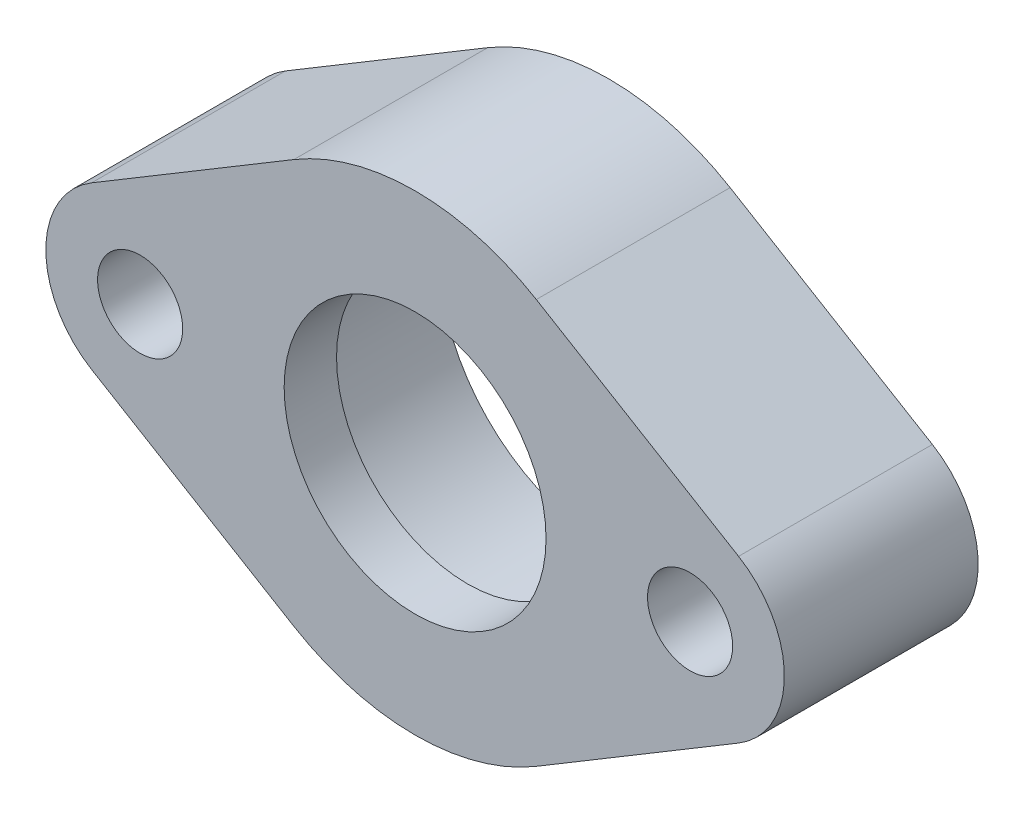
ISO-10303-21;
HEADER;
FILE_DESCRIPTION(('STEP AP214'),'2;1');
FILE_NAME('part.step','',(''),(''),'','','');
FILE_SCHEMA(('AUTOMOTIVE_DESIGN { 1 0 10303 214 1 1 1 1 }'));
ENDSEC;
DATA;
#1=APPLICATION_CONTEXT('core data for automotive mechanical design processes');
#2=APPLICATION_PROTOCOL_DEFINITION('international standard','automotive_design',2000,#1);
#3=PRODUCT_CONTEXT('',#1,'mechanical');
#4=PRODUCT('Part','Part','',(#3));
#5=PRODUCT_RELATED_PRODUCT_CATEGORY('part','',(#4));
#6=PRODUCT_DEFINITION_FORMATION('','',#4);
#7=PRODUCT_DEFINITION_CONTEXT('part definition',#1,'design');
#8=PRODUCT_DEFINITION('design','',#6,#7);
#9=PRODUCT_DEFINITION_SHAPE('','',#8);
#10=(LENGTH_UNIT() NAMED_UNIT(*) SI_UNIT(.MILLI.,.METRE.));
#11=(NAMED_UNIT(*) PLANE_ANGLE_UNIT() SI_UNIT($,.RADIAN.));
#12=(NAMED_UNIT(*) SI_UNIT($,.STERADIAN.) SOLID_ANGLE_UNIT());
#13=UNCERTAINTY_MEASURE_WITH_UNIT(LENGTH_MEASURE(1.E-05),#10,'distance_accuracy_value','');
#14=(GEOMETRIC_REPRESENTATION_CONTEXT(3) GLOBAL_UNCERTAINTY_ASSIGNED_CONTEXT((#13)) GLOBAL_UNIT_ASSIGNED_CONTEXT((#10,
#11,#12)) REPRESENTATION_CONTEXT('',''));
#15=CARTESIAN_POINT('',(0.,0.,0.));
#16=DIRECTION('',(0.,0.,1.));
#17=DIRECTION('',(1.,0.,0.));
#18=AXIS2_PLACEMENT_3D('',#15,#16,#17);
#19=CARTESIAN_POINT('',(-33.3375,0.,0.));
#20=DIRECTION('',(0.,0.,1.));
#21=DIRECTION('',(1.,0.,0.));
#22=AXIS2_PLACEMENT_3D('',#19,#20,#21);
#23=PLANE('',#22);
#24=CARTESIAN_POINT('',(33.3375,0.,0.));
#25=DIRECTION('',(0.,0.,1.));
#26=DIRECTION('',(1.,0.,0.));
#27=AXIS2_PLACEMENT_3D('',#24,#25,#26);
#28=CIRCLE('',#27,5.1562);
#29=CARTESIAN_POINT('',(38.4937,0.,0.));
#30=VERTEX_POINT('',#29);
#31=EDGE_CURVE('E239',#30,#30,#28,.T.);
#32=ORIENTED_EDGE('',*,*,#31,.T.);
#33=EDGE_LOOP('',(#32));
#34=FACE_BOUND('',#33,.T.);
#35=CARTESIAN_POINT('',(-33.3375,0.,0.));
#36=DIRECTION('',(0.,0.,1.));
#37=DIRECTION('',(1.,0.,0.));
#38=AXIS2_PLACEMENT_3D('',#35,#36,#37);
#39=CIRCLE('',#38,11.43);
#40=CARTESIAN_POINT('',(-39.2157857142857,9.8025842032203,0.));
#41=VERTEX_POINT('',#40);
#42=CARTESIAN_POINT('',(-39.2157857142857,-9.80258420322032,0.));
#43=VERTEX_POINT('',#42);
#44=EDGE_CURVE('E133',#41,#43,#39,.T.);
#45=ORIENTED_EDGE('',*,*,#44,.F.);
#46=DIRECTION('',(-0.857618915417351,-0.514285714285714,0.));
#47=VECTOR('',#46,1.);
#48=CARTESIAN_POINT('',(-39.2157857142857,9.8025842032203,0.));
#49=LINE('',#48,#47);
#50=CARTESIAN_POINT('',(-14.6957142857143,24.5064605080508,0.));
#51=VERTEX_POINT('',#50);
#52=EDGE_CURVE('E86',#51,#41,#49,.T.);
#53=ORIENTED_EDGE('',*,*,#52,.F.);
#54=CARTESIAN_POINT('',(0.,0.,0.));
#55=DIRECTION('',(0.,0.,1.));
#56=DIRECTION('',(1.,0.,0.));
#57=AXIS2_PLACEMENT_3D('',#54,#55,#56);
#58=CIRCLE('',#57,28.575);
#59=CARTESIAN_POINT('',(14.6957142857143,24.5064605080508,0.));
#60=VERTEX_POINT('',#59);
#61=EDGE_CURVE('E80',#60,#51,#58,.T.);
#62=ORIENTED_EDGE('',*,*,#61,.F.);
#63=DIRECTION('',(-0.857618915417351,0.514285714285714,0.));
#64=VECTOR('',#63,1.);
#65=CARTESIAN_POINT('',(14.6957142857143,24.5064605080508,0.));
#66=LINE('',#65,#64);
#67=CARTESIAN_POINT('',(39.2157857142857,9.80258420322031,0.));
#68=VERTEX_POINT('',#67);
#69=EDGE_CURVE('E123',#68,#60,#66,.T.);
#70=ORIENTED_EDGE('',*,*,#69,.F.);
#71=CARTESIAN_POINT('',(33.3375,0.,0.));
#72=DIRECTION('',(0.,0.,1.));
#73=DIRECTION('',(1.,0.,0.));
#74=AXIS2_PLACEMENT_3D('',#71,#72,#73);
#75=CIRCLE('',#74,11.43);
#76=CARTESIAN_POINT('',(39.2157857142857,-9.8025842032203,0.));
#77=VERTEX_POINT('',#76);
#78=EDGE_CURVE('E143',#77,#68,#75,.T.);
#79=ORIENTED_EDGE('',*,*,#78,.F.);
#80=DIRECTION('',(0.857618915417351,0.514285714285714,0.));
#81=VECTOR('',#80,1.);
#82=CARTESIAN_POINT('',(39.2157857142857,-9.80258420322031,0.));
#83=LINE('',#82,#81);
#84=CARTESIAN_POINT('',(14.6957142857143,-24.5064605080508,0.));
#85=VERTEX_POINT('',#84);
#86=EDGE_CURVE('E141',#85,#77,#83,.T.);
#87=ORIENTED_EDGE('',*,*,#86,.F.);
#88=CARTESIAN_POINT('',(0.,0.,0.));
#89=DIRECTION('',(0.,0.,1.));
#90=DIRECTION('',(1.,0.,0.));
#91=AXIS2_PLACEMENT_3D('',#88,#89,#90);
#92=CIRCLE('',#91,28.575);
#93=CARTESIAN_POINT('',(-14.6957142857143,-24.5064605080508,0.));
#94=VERTEX_POINT('',#93);
#95=EDGE_CURVE('E139',#94,#85,#92,.T.);
#96=ORIENTED_EDGE('',*,*,#95,.F.);
#97=DIRECTION('',(0.857618915417351,-0.514285714285714,0.));
#98=VECTOR('',#97,1.);
#99=CARTESIAN_POINT('',(-14.6957142857143,-24.5064605080508,0.));
#100=LINE('',#99,#98);
#101=EDGE_CURVE('E136',#43,#94,#100,.T.);
#102=ORIENTED_EDGE('',*,*,#101,.F.);
#103=EDGE_LOOP('',(#45,#53,#62,#70,#79,#87,#96,#102));
#104=FACE_BOUND('',#103,.T.);
#105=CARTESIAN_POINT('',(-33.3375,0.,0.));
#106=DIRECTION('',(0.,0.,1.));
#107=DIRECTION('',(1.,0.,0.));
#108=AXIS2_PLACEMENT_3D('',#105,#106,#107);
#109=CIRCLE('',#108,5.1562);
#110=CARTESIAN_POINT('',(-28.1813,0.,0.));
#111=VERTEX_POINT('',#110);
#112=EDGE_CURVE('E233',#111,#111,#109,.T.);
#113=ORIENTED_EDGE('',*,*,#112,.T.);
#114=EDGE_LOOP('',(#113));
#115=FACE_BOUND('',#114,.T.);
#116=CARTESIAN_POINT('',(0.,0.,0.));
#117=DIRECTION('',(0.,0.,1.));
#118=DIRECTION('',(1.,0.,0.));
#119=AXIS2_PLACEMENT_3D('',#116,#117,#118);
#120=CIRCLE('',#119,20.64385);
#121=CARTESIAN_POINT('',(20.64385,0.,0.));
#122=VERTEX_POINT('',#121);
#123=EDGE_CURVE('E241',#122,#122,#120,.T.);
#124=ORIENTED_EDGE('',*,*,#123,.T.);
#125=EDGE_LOOP('',(#124));
#126=FACE_BOUND('',#125,.T.);
#127=ADVANCED_FACE('F34',(#34,#104,#115,#126),#23,.F.);
#128=CARTESIAN_POINT('',(-33.3375,0.,23.495));
#129=DIRECTION('',(0.,0.,1.));
#130=DIRECTION('',(1.,0.,0.));
#131=AXIS2_PLACEMENT_3D('',#128,#129,#130);
#132=PLANE('',#131);
#133=CARTESIAN_POINT('',(0.,0.,23.495));
#134=DIRECTION('',(0.,0.,-1.));
#135=DIRECTION('',(-1.,0.,0.));
#136=AXIS2_PLACEMENT_3D('',#133,#134,#135);
#137=CIRCLE('',#136,15.875);
#138=CARTESIAN_POINT('',(-15.875,0.,23.495));
#139=VERTEX_POINT('',#138);
#140=EDGE_CURVE('E246',#139,#139,#137,.T.);
#141=ORIENTED_EDGE('',*,*,#140,.T.);
#142=EDGE_LOOP('',(#141));
#143=FACE_BOUND('',#142,.T.);
#144=CARTESIAN_POINT('',(-33.3375,0.,23.495));
#145=DIRECTION('',(0.,0.,1.));
#146=DIRECTION('',(1.,0.,0.));
#147=AXIS2_PLACEMENT_3D('',#144,#145,#146);
#148=CIRCLE('',#147,5.1562);
#149=CARTESIAN_POINT('',(-28.1813,0.,23.495));
#150=VERTEX_POINT('',#149);
#151=EDGE_CURVE('E137',#150,#150,#148,.T.);
#152=ORIENTED_EDGE('',*,*,#151,.F.);
#153=EDGE_LOOP('',(#152));
#154=FACE_BOUND('',#153,.T.);
#155=CARTESIAN_POINT('',(-33.3375,0.,23.495));
#156=DIRECTION('',(0.,0.,1.));
#157=DIRECTION('',(1.,0.,0.));
#158=AXIS2_PLACEMENT_3D('',#155,#156,#157);
#159=CIRCLE('',#158,11.43);
#160=CARTESIAN_POINT('',(-39.2157857142857,9.8025842032203,23.495));
#161=VERTEX_POINT('',#160);
#162=CARTESIAN_POINT('',(-39.2157857142857,-9.80258420322032,23.495));
#163=VERTEX_POINT('',#162);
#164=EDGE_CURVE('E148',#161,#163,#159,.T.);
#165=ORIENTED_EDGE('',*,*,#164,.T.);
#166=DIRECTION('',(0.857618915417351,-0.514285714285714,0.));
#167=VECTOR('',#166,1.);
#168=CARTESIAN_POINT('',(-14.6957142857143,-24.5064605080508,23.495));
#169=LINE('',#168,#167);
#170=CARTESIAN_POINT('',(-14.6957142857143,-24.5064605080508,23.495));
#171=VERTEX_POINT('',#170);
#172=EDGE_CURVE('E95',#163,#171,#169,.T.);
#173=ORIENTED_EDGE('',*,*,#172,.T.);
#174=CARTESIAN_POINT('',(0.,0.,23.495));
#175=DIRECTION('',(0.,0.,1.));
#176=DIRECTION('',(1.,0.,0.));
#177=AXIS2_PLACEMENT_3D('',#174,#175,#176);
#178=CIRCLE('',#177,28.575);
#179=CARTESIAN_POINT('',(14.6957142857143,-24.5064605080508,23.495));
#180=VERTEX_POINT('',#179);
#181=EDGE_CURVE('E225',#171,#180,#178,.T.);
#182=ORIENTED_EDGE('',*,*,#181,.T.);
#183=DIRECTION('',(0.857618915417351,0.514285714285714,0.));
#184=VECTOR('',#183,1.);
#185=CARTESIAN_POINT('',(39.2157857142857,-9.80258420322031,23.495));
#186=LINE('',#185,#184);
#187=CARTESIAN_POINT('',(39.2157857142857,-9.8025842032203,23.495));
#188=VERTEX_POINT('',#187);
#189=EDGE_CURVE('E227',#180,#188,#186,.T.);
#190=ORIENTED_EDGE('',*,*,#189,.T.);
#191=CARTESIAN_POINT('',(33.3375,0.,23.495));
#192=DIRECTION('',(0.,0.,1.));
#193=DIRECTION('',(1.,0.,0.));
#194=AXIS2_PLACEMENT_3D('',#191,#192,#193);
#195=CIRCLE('',#194,11.43);
#196=CARTESIAN_POINT('',(39.2157857142857,9.80258420322031,23.495));
#197=VERTEX_POINT('',#196);
#198=EDGE_CURVE('E115',#188,#197,#195,.T.);
#199=ORIENTED_EDGE('',*,*,#198,.T.);
#200=DIRECTION('',(-0.857618915417351,0.514285714285714,0.));
#201=VECTOR('',#200,1.);
#202=CARTESIAN_POINT('',(14.6957142857143,24.5064605080508,23.495));
#203=LINE('',#202,#201);
#204=CARTESIAN_POINT('',(14.6957142857143,24.5064605080508,23.495));
#205=VERTEX_POINT('',#204);
#206=EDGE_CURVE('E108',#197,#205,#203,.T.);
#207=ORIENTED_EDGE('',*,*,#206,.T.);
#208=CARTESIAN_POINT('',(0.,0.,23.495));
#209=DIRECTION('',(0.,0.,1.));
#210=DIRECTION('',(1.,0.,0.));
#211=AXIS2_PLACEMENT_3D('',#208,#209,#210);
#212=CIRCLE('',#211,28.575);
#213=CARTESIAN_POINT('',(-14.6957142857143,24.5064605080508,23.495));
#214=VERTEX_POINT('',#213);
#215=EDGE_CURVE('E113',#205,#214,#212,.T.);
#216=ORIENTED_EDGE('',*,*,#215,.T.);
#217=DIRECTION('',(-0.857618915417351,-0.514285714285714,0.));
#218=VECTOR('',#217,1.);
#219=CARTESIAN_POINT('',(-39.2157857142857,9.8025842032203,23.495));
#220=LINE('',#219,#218);
#221=EDGE_CURVE('E51',#214,#161,#220,.T.);
#222=ORIENTED_EDGE('',*,*,#221,.T.);
#223=EDGE_LOOP('',(#165,#173,#182,#190,#199,#207,#216,#222));
#224=FACE_BOUND('',#223,.T.);
#225=CARTESIAN_POINT('',(33.3375,0.,23.495));
#226=DIRECTION('',(0.,0.,1.));
#227=DIRECTION('',(1.,0.,0.));
#228=AXIS2_PLACEMENT_3D('',#225,#226,#227);
#229=CIRCLE('',#228,5.1562);
#230=CARTESIAN_POINT('',(38.4937,0.,23.495));
#231=VERTEX_POINT('',#230);
#232=EDGE_CURVE('E236',#231,#231,#229,.T.);
#233=ORIENTED_EDGE('',*,*,#232,.F.);
#234=EDGE_LOOP('',(#233));
#235=FACE_BOUND('',#234,.T.);
#236=ADVANCED_FACE('F110',(#143,#154,#224,#235),#132,.T.);
#237=CARTESIAN_POINT('',(-33.3375,0.,23.495));
#238=DIRECTION('',(0.,0.,-1.));
#239=DIRECTION('',(-1.,0.,0.));
#240=AXIS2_PLACEMENT_3D('',#237,#238,#239);
#241=CYLINDRICAL_SURFACE('',#240,11.43);
#242=ORIENTED_EDGE('',*,*,#44,.T.);
#243=DIRECTION('',(0.,0.,-1.));
#244=VECTOR('',#243,1.);
#245=CARTESIAN_POINT('',(-39.2157857142857,-9.80258420322032,23.495));
#246=LINE('',#245,#244);
#247=EDGE_CURVE('E161',#163,#43,#246,.T.);
#248=ORIENTED_EDGE('',*,*,#247,.F.);
#249=ORIENTED_EDGE('',*,*,#164,.F.);
#250=DIRECTION('',(0.,0.,-1.));
#251=VECTOR('',#250,1.);
#252=CARTESIAN_POINT('',(-39.2157857142857,9.8025842032203,23.495));
#253=LINE('',#252,#251);
#254=EDGE_CURVE('E129',#161,#41,#253,.T.);
#255=ORIENTED_EDGE('',*,*,#254,.T.);
#256=EDGE_LOOP('',(#242,#248,#249,#255));
#257=FACE_BOUND('',#256,.T.);
#258=ADVANCED_FACE('F184',(#257),#241,.T.);
#259=CARTESIAN_POINT('',(-14.6957142857143,-24.5064605080508,23.495));
#260=DIRECTION('',(0.514285714285714,0.857618915417351,0.));
#261=DIRECTION('',(-0.857618915417351,0.514285714285714,0.));
#262=AXIS2_PLACEMENT_3D('',#259,#260,#261);
#263=PLANE('',#262);
#264=ORIENTED_EDGE('',*,*,#101,.T.);
#265=DIRECTION('',(0.,0.,-1.));
#266=VECTOR('',#265,1.);
#267=CARTESIAN_POINT('',(-14.6957142857143,-24.5064605080508,23.495));
#268=LINE('',#267,#266);
#269=EDGE_CURVE('E158',#171,#94,#268,.T.);
#270=ORIENTED_EDGE('',*,*,#269,.F.);
#271=ORIENTED_EDGE('',*,*,#172,.F.);
#272=ORIENTED_EDGE('',*,*,#247,.T.);
#273=EDGE_LOOP('',(#264,#270,#271,#272));
#274=FACE_BOUND('',#273,.T.);
#275=ADVANCED_FACE('F210',(#274),#263,.F.);
#276=CARTESIAN_POINT('',(0.,0.,23.495));
#277=DIRECTION('',(0.,0.,-1.));
#278=DIRECTION('',(-1.,0.,0.));
#279=AXIS2_PLACEMENT_3D('',#276,#277,#278);
#280=CYLINDRICAL_SURFACE('',#279,28.575);
#281=ORIENTED_EDGE('',*,*,#95,.T.);
#282=DIRECTION('',(0.,0.,-1.));
#283=VECTOR('',#282,1.);
#284=CARTESIAN_POINT('',(14.6957142857143,-24.5064605080508,23.495));
#285=LINE('',#284,#283);
#286=EDGE_CURVE('E155',#180,#85,#285,.T.);
#287=ORIENTED_EDGE('',*,*,#286,.F.);
#288=ORIENTED_EDGE('',*,*,#181,.F.);
#289=ORIENTED_EDGE('',*,*,#269,.T.);
#290=EDGE_LOOP('',(#281,#287,#288,#289));
#291=FACE_BOUND('',#290,.T.);
#292=ADVANCED_FACE('F206',(#291),#280,.T.);
#293=CARTESIAN_POINT('',(39.2157857142857,-9.80258420322031,23.495));
#294=DIRECTION('',(-0.514285714285714,0.857618915417351,0.));
#295=DIRECTION('',(-0.857618915417351,-0.514285714285714,0.));
#296=AXIS2_PLACEMENT_3D('',#293,#294,#295);
#297=PLANE('',#296);
#298=ORIENTED_EDGE('',*,*,#86,.T.);
#299=DIRECTION('',(0.,0.,-1.));
#300=VECTOR('',#299,1.);
#301=CARTESIAN_POINT('',(39.2157857142857,-9.8025842032203,23.495));
#302=LINE('',#301,#300);
#303=EDGE_CURVE('E152',#188,#77,#302,.T.);
#304=ORIENTED_EDGE('',*,*,#303,.F.);
#305=ORIENTED_EDGE('',*,*,#189,.F.);
#306=ORIENTED_EDGE('',*,*,#286,.T.);
#307=EDGE_LOOP('',(#298,#304,#305,#306));
#308=FACE_BOUND('',#307,.T.);
#309=ADVANCED_FACE('F202',(#308),#297,.F.);
#310=CARTESIAN_POINT('',(33.3375,0.,23.495));
#311=DIRECTION('',(0.,0.,-1.));
#312=DIRECTION('',(-1.,0.,0.));
#313=AXIS2_PLACEMENT_3D('',#310,#311,#312);
#314=CYLINDRICAL_SURFACE('',#313,11.43);
#315=ORIENTED_EDGE('',*,*,#78,.T.);
#316=DIRECTION('',(0.,0.,-1.));
#317=VECTOR('',#316,1.);
#318=CARTESIAN_POINT('',(39.2157857142857,9.80258420322031,23.495));
#319=LINE('',#318,#317);
#320=EDGE_CURVE('E124',#197,#68,#319,.T.);
#321=ORIENTED_EDGE('',*,*,#320,.F.);
#322=ORIENTED_EDGE('',*,*,#198,.F.);
#323=ORIENTED_EDGE('',*,*,#303,.T.);
#324=EDGE_LOOP('',(#315,#321,#322,#323));
#325=FACE_BOUND('',#324,.T.);
#326=ADVANCED_FACE('F199',(#325),#314,.T.);
#327=CARTESIAN_POINT('',(14.6957142857143,24.5064605080508,23.495));
#328=DIRECTION('',(-0.514285714285714,-0.857618915417351,0.));
#329=DIRECTION('',(0.857618915417351,-0.514285714285714,0.));
#330=AXIS2_PLACEMENT_3D('',#327,#328,#329);
#331=PLANE('',#330);
#332=ORIENTED_EDGE('',*,*,#69,.T.);
#333=DIRECTION('',(0.,0.,-1.));
#334=VECTOR('',#333,1.);
#335=CARTESIAN_POINT('',(14.6957142857143,24.5064605080508,23.495));
#336=LINE('',#335,#334);
#337=EDGE_CURVE('E120',#205,#60,#336,.T.);
#338=ORIENTED_EDGE('',*,*,#337,.F.);
#339=ORIENTED_EDGE('',*,*,#206,.F.);
#340=ORIENTED_EDGE('',*,*,#320,.T.);
#341=EDGE_LOOP('',(#332,#338,#339,#340));
#342=FACE_BOUND('',#341,.T.);
#343=ADVANCED_FACE('F121',(#342),#331,.F.);
#344=CARTESIAN_POINT('',(0.,0.,23.495));
#345=DIRECTION('',(0.,0.,-1.));
#346=DIRECTION('',(-1.,0.,0.));
#347=AXIS2_PLACEMENT_3D('',#344,#345,#346);
#348=CYLINDRICAL_SURFACE('',#347,28.575);
#349=ORIENTED_EDGE('',*,*,#61,.T.);
#350=DIRECTION('',(0.,0.,-1.));
#351=VECTOR('',#350,1.);
#352=CARTESIAN_POINT('',(-14.6957142857143,24.5064605080508,23.495));
#353=LINE('',#352,#351);
#354=EDGE_CURVE('E125',#214,#51,#353,.T.);
#355=ORIENTED_EDGE('',*,*,#354,.F.);
#356=ORIENTED_EDGE('',*,*,#215,.F.);
#357=ORIENTED_EDGE('',*,*,#337,.T.);
#358=EDGE_LOOP('',(#349,#355,#356,#357));
#359=FACE_BOUND('',#358,.T.);
#360=ADVANCED_FACE('F127',(#359),#348,.T.);
#361=CARTESIAN_POINT('',(-39.2157857142857,9.8025842032203,23.495));
#362=DIRECTION('',(0.514285714285714,-0.857618915417351,0.));
#363=DIRECTION('',(0.857618915417351,0.514285714285714,0.));
#364=AXIS2_PLACEMENT_3D('',#361,#362,#363);
#365=PLANE('',#364);
#366=ORIENTED_EDGE('',*,*,#52,.T.);
#367=ORIENTED_EDGE('',*,*,#254,.F.);
#368=ORIENTED_EDGE('',*,*,#221,.F.);
#369=ORIENTED_EDGE('',*,*,#354,.T.);
#370=EDGE_LOOP('',(#366,#367,#368,#369));
#371=FACE_BOUND('',#370,.T.);
#372=ADVANCED_FACE('F191',(#371),#365,.F.);
#373=CARTESIAN_POINT('',(-33.3375,0.,23.495));
#374=DIRECTION('',(0.,0.,-1.));
#375=DIRECTION('',(-1.,0.,0.));
#376=AXIS2_PLACEMENT_3D('',#373,#374,#375);
#377=CYLINDRICAL_SURFACE('',#376,5.1562);
#378=ORIENTED_EDGE('',*,*,#151,.T.);
#379=EDGE_LOOP('',(#378));
#380=FACE_BOUND('',#379,.T.);
#381=ORIENTED_EDGE('',*,*,#112,.F.);
#382=EDGE_LOOP('',(#381));
#383=FACE_BOUND('',#382,.T.);
#384=ADVANCED_FACE('F194',(#380,#383),#377,.F.);
#385=CARTESIAN_POINT('',(33.3375,0.,23.495));
#386=DIRECTION('',(0.,0.,-1.));
#387=DIRECTION('',(-1.,0.,0.));
#388=AXIS2_PLACEMENT_3D('',#385,#386,#387);
#389=CYLINDRICAL_SURFACE('',#388,5.1562);
#390=ORIENTED_EDGE('',*,*,#232,.T.);
#391=EDGE_LOOP('',(#390));
#392=FACE_BOUND('',#391,.T.);
#393=ORIENTED_EDGE('',*,*,#31,.F.);
#394=EDGE_LOOP('',(#393));
#395=FACE_BOUND('',#394,.T.);
#396=ADVANCED_FACE('F262',(#392,#395),#389,.F.);
#397=CARTESIAN_POINT('',(0.,0.,17.145));
#398=DIRECTION('',(0.,0.,-1.));
#399=DIRECTION('',(-1.,0.,0.));
#400=AXIS2_PLACEMENT_3D('',#397,#398,#399);
#401=CYLINDRICAL_SURFACE('',#400,20.64385);
#402=CARTESIAN_POINT('',(0.,0.,17.018));
#403=DIRECTION('',(0.,0.,1.));
#404=DIRECTION('',(1.,0.,0.));
#405=AXIS2_PLACEMENT_3D('',#402,#403,#404);
#406=CIRCLE('',#405,20.64385);
#407=CARTESIAN_POINT('',(20.64385,0.,17.018));
#408=VERTEX_POINT('',#407);
#409=EDGE_CURVE('E43',#408,#408,#406,.T.);
#410=ORIENTED_EDGE('',*,*,#409,.T.);
#411=EDGE_LOOP('',(#410));
#412=FACE_BOUND('',#411,.T.);
#413=ORIENTED_EDGE('',*,*,#123,.F.);
#414=EDGE_LOOP('',(#413));
#415=FACE_BOUND('',#414,.T.);
#416=ADVANCED_FACE('F165',(#412,#415),#401,.F.);
#417=CARTESIAN_POINT('',(0.,0.,17.145));
#418=DIRECTION('',(0.,0.,1.));
#419=DIRECTION('',(1.,0.,0.));
#420=AXIS2_PLACEMENT_3D('',#417,#418,#419);
#421=PLANE('',#420);
#422=CARTESIAN_POINT('',(0.,0.,17.145));
#423=DIRECTION('',(0.,0.,1.));
#424=DIRECTION('',(1.,0.,0.));
#425=AXIS2_PLACEMENT_3D('',#422,#423,#424);
#426=CIRCLE('',#425,20.51685);
#427=CARTESIAN_POINT('',(20.51685,0.,17.145));
#428=VERTEX_POINT('',#427);
#429=EDGE_CURVE('E11',#428,#428,#426,.F.);
#430=ORIENTED_EDGE('',*,*,#429,.T.);
#431=EDGE_LOOP('',(#430));
#432=FACE_BOUND('',#431,.T.);
#433=CARTESIAN_POINT('',(0.,0.,17.145));
#434=DIRECTION('',(0.,0.,-1.));
#435=DIRECTION('',(-1.,0.,0.));
#436=AXIS2_PLACEMENT_3D('',#433,#434,#435);
#437=CIRCLE('',#436,15.875);
#438=CARTESIAN_POINT('',(-15.875,0.,17.145));
#439=VERTEX_POINT('',#438);
#440=EDGE_CURVE('E247',#439,#439,#437,.T.);
#441=ORIENTED_EDGE('',*,*,#440,.F.);
#442=EDGE_LOOP('',(#441));
#443=FACE_BOUND('',#442,.T.);
#444=ADVANCED_FACE('F174',(#432,#443),#421,.F.);
#445=CARTESIAN_POINT('',(0.,0.,23.495));
#446=DIRECTION('',(0.,0.,-1.));
#447=DIRECTION('',(-1.,0.,0.));
#448=AXIS2_PLACEMENT_3D('',#445,#446,#447);
#449=CYLINDRICAL_SURFACE('',#448,15.875);
#450=ORIENTED_EDGE('',*,*,#140,.F.);
#451=EDGE_LOOP('',(#450));
#452=FACE_BOUND('',#451,.T.);
#453=ORIENTED_EDGE('',*,*,#440,.T.);
#454=EDGE_LOOP('',(#453));
#455=FACE_BOUND('',#454,.T.);
#456=ADVANCED_FACE('F169',(#452,#455),#449,.F.);
#457=CARTESIAN_POINT('',(0.,0.,17.018));
#458=DIRECTION('',(0.,0.,1.));
#459=DIRECTION('',(1.,0.,0.));
#460=AXIS2_PLACEMENT_3D('',#457,#458,#459);
#461=TOROIDAL_SURFACE('',#460,20.51685,0.127);
#462=ORIENTED_EDGE('',*,*,#429,.F.);
#463=EDGE_LOOP('',(#462));
#464=FACE_BOUND('',#463,.T.);
#465=ORIENTED_EDGE('',*,*,#409,.F.);
#466=EDGE_LOOP('',(#465));
#467=FACE_BOUND('',#466,.T.);
#468=ADVANCED_FACE('F36',(#464,#467),#461,.F.);
#469=CLOSED_SHELL('',(#127,#236,#258,#275,#292,#309,#326,#343,#360,#372,#384,#396,#416,#444,
#456,#468));
#470=MANIFOLD_SOLID_BREP('B2',#469);
#471=ADVANCED_BREP_SHAPE_REPRESENTATION('',(#18,#470),#14);
#472=SHAPE_DEFINITION_REPRESENTATION(#9,#471);
ENDSEC;
END-ISO-10303-21;
